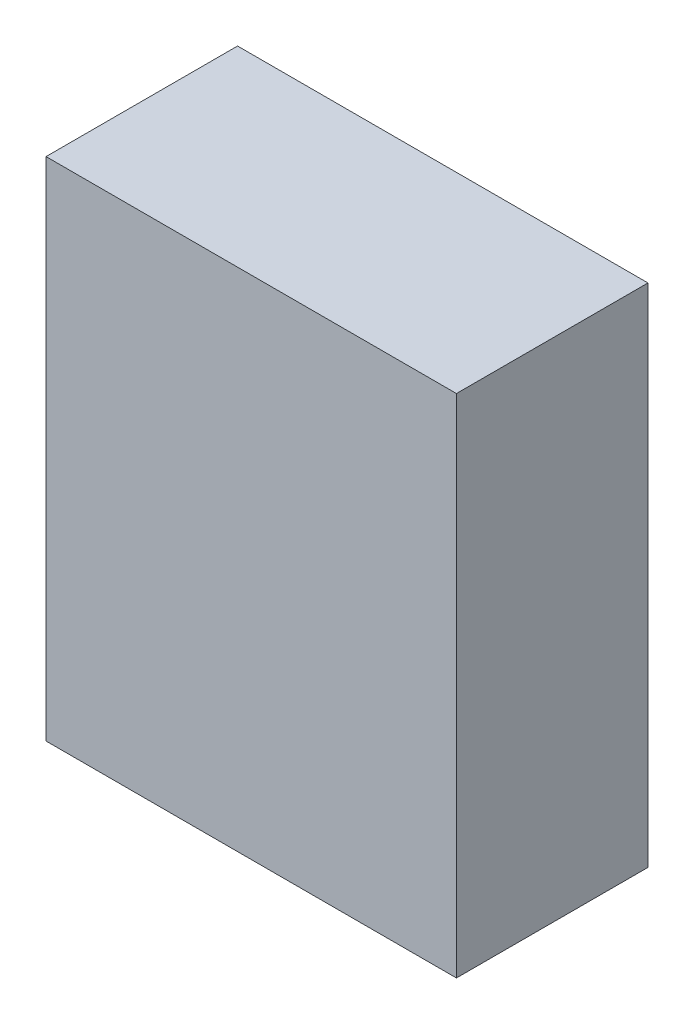
ISO-10303-21;
HEADER;
FILE_DESCRIPTION(('STEP AP214'),'2;1');
FILE_NAME('part.step','',(''),(''),'','','');
FILE_SCHEMA(('AUTOMOTIVE_DESIGN { 1 0 10303 214 1 1 1 1 }'));
ENDSEC;
DATA;
#1=APPLICATION_CONTEXT('core data for automotive mechanical design processes');
#2=APPLICATION_PROTOCOL_DEFINITION('international standard','automotive_design',2000,#1);
#3=PRODUCT_CONTEXT('',#1,'mechanical');
#4=PRODUCT('Part','Part','',(#3));
#5=PRODUCT_RELATED_PRODUCT_CATEGORY('part','',(#4));
#6=PRODUCT_DEFINITION_FORMATION('','',#4);
#7=PRODUCT_DEFINITION_CONTEXT('part definition',#1,'design');
#8=PRODUCT_DEFINITION('design','',#6,#7);
#9=PRODUCT_DEFINITION_SHAPE('','',#8);
#10=(LENGTH_UNIT() NAMED_UNIT(*) SI_UNIT(.MILLI.,.METRE.));
#11=(NAMED_UNIT(*) PLANE_ANGLE_UNIT() SI_UNIT($,.RADIAN.));
#12=(NAMED_UNIT(*) SI_UNIT($,.STERADIAN.) SOLID_ANGLE_UNIT());
#13=UNCERTAINTY_MEASURE_WITH_UNIT(LENGTH_MEASURE(1.E-05),#10,'distance_accuracy_value','');
#14=(GEOMETRIC_REPRESENTATION_CONTEXT(3) GLOBAL_UNCERTAINTY_ASSIGNED_CONTEXT((#13)) GLOBAL_UNIT_ASSIGNED_CONTEXT((#10,
#11,#12)) REPRESENTATION_CONTEXT('',''));
#15=CARTESIAN_POINT('',(0.,0.,0.));
#16=DIRECTION('',(0.,0.,1.));
#17=DIRECTION('',(1.,0.,0.));
#18=AXIS2_PLACEMENT_3D('',#15,#16,#17);
#19=CARTESIAN_POINT('',(23.8125,-29.36875,22.225));
#20=DIRECTION('',(-1.,0.,0.));
#21=DIRECTION('',(0.,0.,1.));
#22=AXIS2_PLACEMENT_3D('',#19,#20,#21);
#23=PLANE('',#22);
#24=DIRECTION('',(0.,1.,0.));
#25=VECTOR('',#24,1.);
#26=CARTESIAN_POINT('',(23.8125,-29.36875,0.));
#27=LINE('',#26,#25);
#28=CARTESIAN_POINT('',(23.8125,-29.36875,0.));
#29=VERTEX_POINT('',#28);
#30=CARTESIAN_POINT('',(23.8125,29.36875,0.));
#31=VERTEX_POINT('',#30);
#32=EDGE_CURVE('E96',#29,#31,#27,.T.);
#33=ORIENTED_EDGE('',*,*,#32,.T.);
#34=DIRECTION('',(0.,0.,-1.));
#35=VECTOR('',#34,1.);
#36=CARTESIAN_POINT('',(23.8125,29.36875,22.225));
#37=LINE('',#36,#35);
#38=CARTESIAN_POINT('',(23.8125,29.36875,22.225));
#39=VERTEX_POINT('',#38);
#40=EDGE_CURVE('E11',#39,#31,#37,.T.);
#41=ORIENTED_EDGE('',*,*,#40,.F.);
#42=DIRECTION('',(0.,1.,0.));
#43=VECTOR('',#42,1.);
#44=CARTESIAN_POINT('',(23.8125,-29.36875,22.225));
#45=LINE('',#44,#43);
#46=CARTESIAN_POINT('',(23.8125,-29.36875,22.225));
#47=VERTEX_POINT('',#46);
#48=EDGE_CURVE('E84',#47,#39,#45,.T.);
#49=ORIENTED_EDGE('',*,*,#48,.F.);
#50=DIRECTION('',(0.,0.,-1.));
#51=VECTOR('',#50,1.);
#52=CARTESIAN_POINT('',(23.8125,-29.36875,22.225));
#53=LINE('',#52,#51);
#54=EDGE_CURVE('E92',#47,#29,#53,.T.);
#55=ORIENTED_EDGE('',*,*,#54,.T.);
#56=EDGE_LOOP('',(#33,#41,#49,#55));
#57=FACE_BOUND('',#56,.T.);
#58=ADVANCED_FACE('F33',(#57),#23,.F.);
#59=CARTESIAN_POINT('',(-23.8125,29.36875,22.225));
#60=DIRECTION('',(0.,-1.,0.));
#61=DIRECTION('',(0.,0.,-1.));
#62=AXIS2_PLACEMENT_3D('',#59,#60,#61);
#63=PLANE('',#62);
#64=DIRECTION('',(-1.,0.,0.));
#65=VECTOR('',#64,1.);
#66=CARTESIAN_POINT('',(-23.8125,29.36875,0.));
#67=LINE('',#66,#65);
#68=CARTESIAN_POINT('',(-23.8125,29.36875,0.));
#69=VERTEX_POINT('',#68);
#70=EDGE_CURVE('E88',#31,#69,#67,.T.);
#71=ORIENTED_EDGE('',*,*,#70,.T.);
#72=DIRECTION('',(0.,0.,-1.));
#73=VECTOR('',#72,1.);
#74=CARTESIAN_POINT('',(-23.8125,29.36875,22.225));
#75=LINE('',#74,#73);
#76=CARTESIAN_POINT('',(-23.8125,29.36875,22.225));
#77=VERTEX_POINT('',#76);
#78=EDGE_CURVE('E41',#77,#69,#75,.T.);
#79=ORIENTED_EDGE('',*,*,#78,.F.);
#80=DIRECTION('',(-1.,0.,0.));
#81=VECTOR('',#80,1.);
#82=CARTESIAN_POINT('',(-23.8125,29.36875,22.225));
#83=LINE('',#82,#81);
#84=EDGE_CURVE('E79',#39,#77,#83,.T.);
#85=ORIENTED_EDGE('',*,*,#84,.F.);
#86=ORIENTED_EDGE('',*,*,#40,.T.);
#87=EDGE_LOOP('',(#71,#79,#85,#86));
#88=FACE_BOUND('',#87,.T.);
#89=ADVANCED_FACE('F87',(#88),#63,.F.);
#90=CARTESIAN_POINT('',(-23.8125,-29.36875,22.225));
#91=DIRECTION('',(1.,0.,0.));
#92=DIRECTION('',(0.,0.,-1.));
#93=AXIS2_PLACEMENT_3D('',#90,#91,#92);
#94=PLANE('',#93);
#95=DIRECTION('',(0.,-1.,0.));
#96=VECTOR('',#95,1.);
#97=CARTESIAN_POINT('',(-23.8125,-29.36875,0.));
#98=LINE('',#97,#96);
#99=CARTESIAN_POINT('',(-23.8125,-29.36875,0.));
#100=VERTEX_POINT('',#99);
#101=EDGE_CURVE('E66',#69,#100,#98,.T.);
#102=ORIENTED_EDGE('',*,*,#101,.T.);
#103=DIRECTION('',(0.,0.,-1.));
#104=VECTOR('',#103,1.);
#105=CARTESIAN_POINT('',(-23.8125,-29.36875,22.225));
#106=LINE('',#105,#104);
#107=CARTESIAN_POINT('',(-23.8125,-29.36875,22.225));
#108=VERTEX_POINT('',#107);
#109=EDGE_CURVE('E89',#108,#100,#106,.T.);
#110=ORIENTED_EDGE('',*,*,#109,.F.);
#111=DIRECTION('',(0.,-1.,0.));
#112=VECTOR('',#111,1.);
#113=CARTESIAN_POINT('',(-23.8125,-29.36875,22.225));
#114=LINE('',#113,#112);
#115=EDGE_CURVE('E82',#77,#108,#114,.T.);
#116=ORIENTED_EDGE('',*,*,#115,.F.);
#117=ORIENTED_EDGE('',*,*,#78,.T.);
#118=EDGE_LOOP('',(#102,#110,#116,#117));
#119=FACE_BOUND('',#118,.T.);
#120=ADVANCED_FACE('F90',(#119),#94,.F.);
#121=CARTESIAN_POINT('',(-23.8125,-29.36875,22.225));
#122=DIRECTION('',(0.,1.,0.));
#123=DIRECTION('',(0.,0.,1.));
#124=AXIS2_PLACEMENT_3D('',#121,#122,#123);
#125=PLANE('',#124);
#126=DIRECTION('',(1.,0.,0.));
#127=VECTOR('',#126,1.);
#128=CARTESIAN_POINT('',(-23.8125,-29.36875,0.));
#129=LINE('',#128,#127);
#130=EDGE_CURVE('E72',#100,#29,#129,.T.);
#131=ORIENTED_EDGE('',*,*,#130,.T.);
#132=ORIENTED_EDGE('',*,*,#54,.F.);
#133=DIRECTION('',(1.,0.,0.));
#134=VECTOR('',#133,1.);
#135=CARTESIAN_POINT('',(-23.8125,-29.36875,22.225));
#136=LINE('',#135,#134);
#137=EDGE_CURVE('E49',#108,#47,#136,.T.);
#138=ORIENTED_EDGE('',*,*,#137,.F.);
#139=ORIENTED_EDGE('',*,*,#109,.T.);
#140=EDGE_LOOP('',(#131,#132,#138,#139));
#141=FACE_BOUND('',#140,.T.);
#142=ADVANCED_FACE('F103',(#141),#125,.F.);
#143=CARTESIAN_POINT('',(0.,0.,22.225));
#144=DIRECTION('',(0.,0.,-1.));
#145=DIRECTION('',(-1.,0.,0.));
#146=AXIS2_PLACEMENT_3D('',#143,#144,#145);
#147=PLANE('',#146);
#148=ORIENTED_EDGE('',*,*,#48,.T.);
#149=ORIENTED_EDGE('',*,*,#84,.T.);
#150=ORIENTED_EDGE('',*,*,#115,.T.);
#151=ORIENTED_EDGE('',*,*,#137,.T.);
#152=EDGE_LOOP('',(#148,#149,#150,#151));
#153=FACE_BOUND('',#152,.T.);
#154=ADVANCED_FACE('F80',(#153),#147,.F.);
#155=CARTESIAN_POINT('',(0.,0.,0.));
#156=DIRECTION('',(0.,0.,-1.));
#157=DIRECTION('',(-1.,0.,0.));
#158=AXIS2_PLACEMENT_3D('',#155,#156,#157);
#159=PLANE('',#158);
#160=ORIENTED_EDGE('',*,*,#32,.F.);
#161=ORIENTED_EDGE('',*,*,#130,.F.);
#162=ORIENTED_EDGE('',*,*,#101,.F.);
#163=ORIENTED_EDGE('',*,*,#70,.F.);
#164=EDGE_LOOP('',(#160,#161,#162,#163));
#165=FACE_BOUND('',#164,.T.);
#166=ADVANCED_FACE('F106',(#165),#159,.T.);
#167=CLOSED_SHELL('',(#58,#89,#120,#142,#154,#166));
#168=MANIFOLD_SOLID_BREP('B2',#167);
#169=ADVANCED_BREP_SHAPE_REPRESENTATION('',(#18,#168),#14);
#170=SHAPE_DEFINITION_REPRESENTATION(#9,#169);
ENDSEC;
END-ISO-10303-21;
